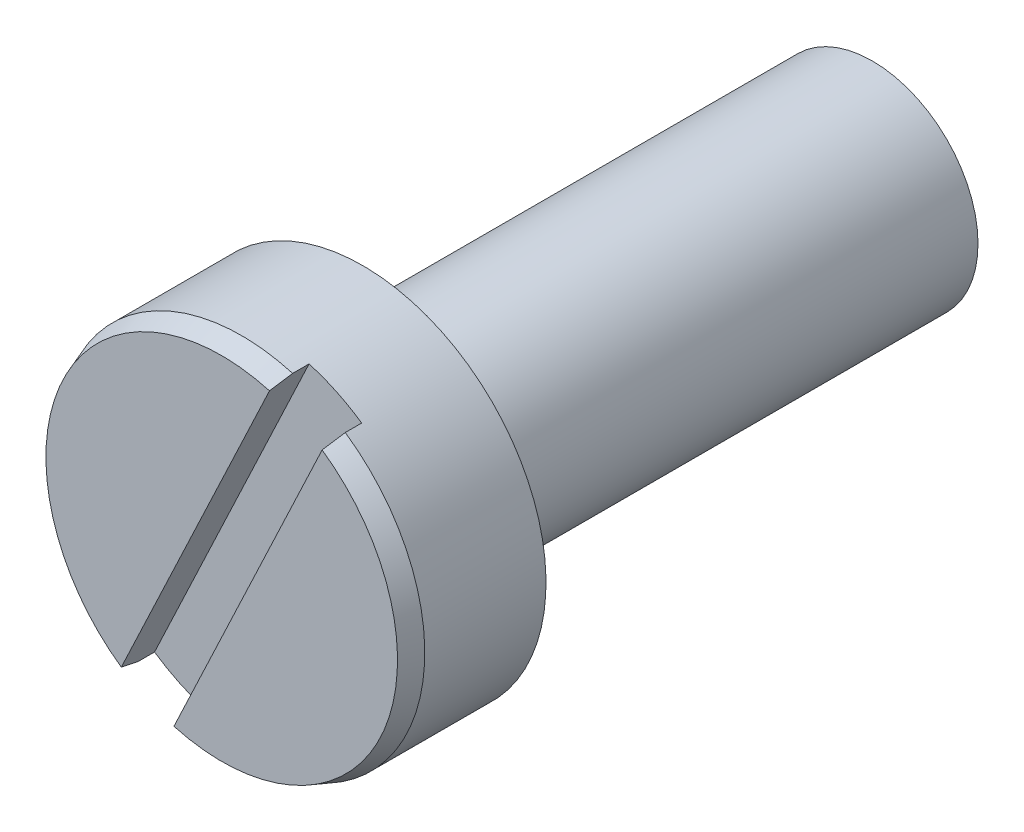
ISO-10303-21;
HEADER;
FILE_DESCRIPTION(('STEP AP214'),'2;1');
FILE_NAME('part.step','',(''),(''),'','','');
FILE_SCHEMA(('AUTOMOTIVE_DESIGN { 1 0 10303 214 1 1 1 1 }'));
ENDSEC;
DATA;
#1=APPLICATION_CONTEXT('core data for automotive mechanical design processes');
#2=APPLICATION_PROTOCOL_DEFINITION('international standard','automotive_design',2000,#1);
#3=PRODUCT_CONTEXT('',#1,'mechanical');
#4=PRODUCT('Part','Part','',(#3));
#5=PRODUCT_RELATED_PRODUCT_CATEGORY('part','',(#4));
#6=PRODUCT_DEFINITION_FORMATION('','',#4);
#7=PRODUCT_DEFINITION_CONTEXT('part definition',#1,'design');
#8=PRODUCT_DEFINITION('design','',#6,#7);
#9=PRODUCT_DEFINITION_SHAPE('','',#8);
#10=(LENGTH_UNIT() NAMED_UNIT(*) SI_UNIT(.MILLI.,.METRE.));
#11=(NAMED_UNIT(*) PLANE_ANGLE_UNIT() SI_UNIT($,.RADIAN.));
#12=(NAMED_UNIT(*) SI_UNIT($,.STERADIAN.) SOLID_ANGLE_UNIT());
#13=UNCERTAINTY_MEASURE_WITH_UNIT(LENGTH_MEASURE(1.E-05),#10,'distance_accuracy_value','');
#14=(GEOMETRIC_REPRESENTATION_CONTEXT(3) GLOBAL_UNCERTAINTY_ASSIGNED_CONTEXT((#13)) GLOBAL_UNIT_ASSIGNED_CONTEXT((#10,
#11,#12)) REPRESENTATION_CONTEXT('',''));
#15=CARTESIAN_POINT('',(0.,0.,0.));
#16=DIRECTION('',(0.,0.,1.));
#17=DIRECTION('',(1.,0.,0.));
#18=AXIS2_PLACEMENT_3D('',#15,#16,#17);
#19=CARTESIAN_POINT('',(-22.8478019032069,-23.3190294111925,19.8));
#20=DIRECTION('',(0.,0.,-1.));
#21=DIRECTION('',(0.427457329703379,0.904035525453982,0.));
#22=AXIS2_PLACEMENT_3D('',#19,#20,#21);
#23=TOROIDAL_SURFACE('',#22,1.95,0.5);
#24=CARTESIAN_POINT('',(-22.8478019032069,-23.3190294111925,19.8));
#25=DIRECTION('',(0.,0.,-1.));
#26=DIRECTION('',(0.427457329703379,0.904035525453982,0.));
#27=AXIS2_PLACEMENT_3D('',#24,#25,#26);
#28=CIRCLE('',#27,1.45);
#29=CARTESIAN_POINT('',(-22.227988775137,-22.0081778992842,19.8));
#30=VERTEX_POINT('',#29);
#31=EDGE_CURVE('E11',#30,#30,#28,.T.);
#32=ORIENTED_EDGE('',*,*,#31,.F.);
#33=EDGE_LOOP('',(#32));
#34=FACE_BOUND('',#33,.T.);
#35=CARTESIAN_POINT('',(-22.8478019032069,-23.3190294111928,20.3));
#36=DIRECTION('',(0.,0.,1.));
#37=DIRECTION('',(0.427457329703379,0.904035525453982,0.));
#38=AXIS2_PLACEMENT_3D('',#35,#36,#37);
#39=CIRCLE('',#38,1.95);
#40=CARTESIAN_POINT('',(-22.0142601102853,-21.5561601365575,20.3));
#41=VERTEX_POINT('',#40);
#42=EDGE_CURVE('E125',#41,#41,#39,.T.);
#43=ORIENTED_EDGE('',*,*,#42,.F.);
#44=EDGE_LOOP('',(#43));
#45=FACE_BOUND('',#44,.T.);
#46=ADVANCED_FACE('F17',(#34,#45),#23,.F.);
#47=CARTESIAN_POINT('',(-22.8478019032069,-23.3190294111927,13.3));
#48=DIRECTION('',(0.,0.,1.));
#49=DIRECTION('',(-0.427457329703379,-0.904035525453982,0.));
#50=AXIS2_PLACEMENT_3D('',#47,#48,#49);
#51=CONICAL_SURFACE('',#50,1.175252258055,1.221730476396);
#52=CARTESIAN_POINT('',(-22.8478019032069,-23.3190294111927,13.3));
#53=DIRECTION('',(0.,0.,-1.));
#54=DIRECTION('',(0.427457329703379,0.904035525453982,0.));
#55=AXIS2_PLACEMENT_3D('',#52,#53,#54);
#56=CIRCLE('',#55,1.175252258055);
#57=CARTESIAN_POINT('',(-22.3454317112508,-22.2565596185409,13.3));
#58=VERTEX_POINT('',#57);
#59=EDGE_CURVE('E110',#58,#58,#56,.T.);
#60=ORIENTED_EDGE('',*,*,#59,.F.);
#61=EDGE_LOOP('',(#60));
#62=FACE_BOUND('',#61,.T.);
#63=CARTESIAN_POINT('',(-22.8478019032069,-23.3190294111925,13.4));
#64=DIRECTION('',(0.,0.,1.));
#65=DIRECTION('',(0.427457329703379,0.904035525453982,0.));
#66=AXIS2_PLACEMENT_3D('',#63,#64,#65);
#67=CIRCLE('',#66,1.45);
#68=CARTESIAN_POINT('',(-22.227988775137,-22.0081778992842,13.4));
#69=VERTEX_POINT('',#68);
#70=EDGE_CURVE('E26',#69,#69,#67,.T.);
#71=ORIENTED_EDGE('',*,*,#70,.F.);
#72=EDGE_LOOP('',(#71));
#73=FACE_BOUND('',#72,.T.);
#74=ADVANCED_FACE('F181',(#62,#73),#51,.T.);
#75=CARTESIAN_POINT('',(-22.8478019032069,-23.3190294111928,20.3));
#76=DIRECTION('',(0.,0.,1.));
#77=DIRECTION('',(-0.427457329703379,-0.904035525453982,0.));
#78=AXIS2_PLACEMENT_3D('',#75,#76,#77);
#79=CONICAL_SURFACE('',#78,2.240252258055,1.221730476396);
#80=CARTESIAN_POINT('',(-22.8478019032069,-23.3190294111928,20.3));
#81=DIRECTION('',(0.,0.,-1.));
#82=DIRECTION('',(0.427457329703379,0.904035525453982,0.));
#83=AXIS2_PLACEMENT_3D('',#80,#81,#82);
#84=CIRCLE('',#83,2.240252258055);
#85=CARTESIAN_POINT('',(-21.8901896551167,-21.2937617839326,20.3));
#86=VERTEX_POINT('',#85);
#87=EDGE_CURVE('E121',#86,#86,#84,.T.);
#88=ORIENTED_EDGE('',*,*,#87,.F.);
#89=EDGE_LOOP('',(#88));
#90=FACE_BOUND('',#89,.T.);
#91=CARTESIAN_POINT('',(-22.8478019032069,-23.3190294111927,20.4));
#92=DIRECTION('',(0.,0.,1.));
#93=DIRECTION('',(0.427457329703379,0.904035525453982,0.));
#94=AXIS2_PLACEMENT_3D('',#91,#92,#93);
#95=CIRCLE('',#94,2.515);
#96=CARTESIAN_POINT('',(-21.7727467190029,-21.0453800646759,20.4));
#97=VERTEX_POINT('',#96);
#98=EDGE_CURVE('E68',#97,#97,#95,.T.);
#99=ORIENTED_EDGE('',*,*,#98,.F.);
#100=EDGE_LOOP('',(#99));
#101=FACE_BOUND('',#100,.T.);
#102=ADVANCED_FACE('F186',(#90,#101),#79,.T.);
#103=CARTESIAN_POINT('',(-22.8478019032069,-23.3190294111927,13.3));
#104=DIRECTION('',(0.,0.,-1.));
#105=DIRECTION('',(0.427457329703379,0.904035525453982,0.));
#106=AXIS2_PLACEMENT_3D('',#103,#104,#105);
#107=CYLINDRICAL_SURFACE('',#106,1.45);
#108=ORIENTED_EDGE('',*,*,#31,.T.);
#109=EDGE_LOOP('',(#108));
#110=FACE_BOUND('',#109,.T.);
#111=ORIENTED_EDGE('',*,*,#70,.T.);
#112=EDGE_LOOP('',(#111));
#113=FACE_BOUND('',#112,.T.);
#114=ADVANCED_FACE('F174',(#110,#113),#107,.T.);
#115=CARTESIAN_POINT('',(-22.8478019032069,-23.3190294111927,13.3));
#116=DIRECTION('',(0.,0.,-1.));
#117=DIRECTION('',(0.427457329703379,0.904035525453982,0.));
#118=AXIS2_PLACEMENT_3D('',#115,#116,#117);
#119=CYLINDRICAL_SURFACE('',#118,2.515);
#120=CARTESIAN_POINT('',(-22.8478019032069,-23.3190294111933,21.84));
#121=DIRECTION('',(0.,0.,-1.));
#122=DIRECTION('',(-0.427457329703369,-0.904035525453986,0.));
#123=AXIS2_PLACEMENT_3D('',#120,#121,#122);
#124=CIRCLE('',#123,2.515);
#125=CARTESIAN_POINT('',(-23.5475587337498,-25.7347209018659,21.84));
#126=VERTEX_POINT('',#125);
#127=CARTESIAN_POINT('',(-24.2707871541138,-25.3927550381032,21.84));
#128=VERTEX_POINT('',#127);
#129=EDGE_CURVE('E145',#126,#128,#124,.T.);
#130=ORIENTED_EDGE('',*,*,#129,.T.);
#131=DIRECTION('',(0.,0.,-1.));
#132=VECTOR('',#131,1.);
#133=CARTESIAN_POINT('',(-24.2707871541128,-25.3927550381031,13.3));
#134=LINE('',#133,#132);
#135=CARTESIAN_POINT('',(-24.2707871541138,-25.3927550381032,22.0652522580551));
#136=VERTEX_POINT('',#135);
#137=EDGE_CURVE('E64',#136,#128,#134,.T.);
#138=ORIENTED_EDGE('',*,*,#137,.F.);
#139=CARTESIAN_POINT('',(-22.8478019032069,-23.3190294111931,22.065252258055));
#140=DIRECTION('',(0.,0.,-1.));
#141=DIRECTION('',(-0.427457329703379,-0.904035525453982,0.));
#142=AXIS2_PLACEMENT_3D('',#139,#140,#141);
#143=CIRCLE('',#142,2.515);
#144=CARTESIAN_POINT('',(-22.1480450726639,-20.9033379205202,22.0652522580551));
#145=VERTEX_POINT('',#144);
#146=EDGE_CURVE('E53',#136,#145,#143,.T.);
#147=ORIENTED_EDGE('',*,*,#146,.T.);
#148=DIRECTION('',(0.,0.,1.));
#149=VECTOR('',#148,1.);
#150=CARTESIAN_POINT('',(-22.1480450726639,-20.9033379205197,13.3));
#151=LINE('',#150,#149);
#152=CARTESIAN_POINT('',(-22.1480450726639,-20.9033379205203,21.84));
#153=VERTEX_POINT('',#152);
#154=EDGE_CURVE('E61',#153,#145,#151,.T.);
#155=ORIENTED_EDGE('',*,*,#154,.F.);
#156=CARTESIAN_POINT('',(-22.8478019032069,-23.3190294111933,21.84));
#157=DIRECTION('',(0.,0.,-1.));
#158=DIRECTION('',(-0.427457329703379,-0.904035525453982,0.));
#159=AXIS2_PLACEMENT_3D('',#156,#157,#158);
#160=CIRCLE('',#159,2.515);
#161=CARTESIAN_POINT('',(-21.4248166523009,-21.2453037842822,21.84));
#162=VERTEX_POINT('',#161);
#163=EDGE_CURVE('E93',#153,#162,#160,.T.);
#164=ORIENTED_EDGE('',*,*,#163,.T.);
#165=DIRECTION('',(0.,0.,-1.));
#166=VECTOR('',#165,1.);
#167=CARTESIAN_POINT('',(-21.4248166522999,-21.2453037842826,13.3));
#168=LINE('',#167,#166);
#169=CARTESIAN_POINT('',(-21.4248166523009,-21.2453037842831,22.0652522580551));
#170=VERTEX_POINT('',#169);
#171=EDGE_CURVE('E96',#170,#162,#168,.T.);
#172=ORIENTED_EDGE('',*,*,#171,.F.);
#173=CARTESIAN_POINT('',(-23.5475587337498,-25.7347209018659,22.0652522580551));
#174=VERTEX_POINT('',#173);
#175=EDGE_CURVE('E106',#170,#174,#143,.T.);
#176=ORIENTED_EDGE('',*,*,#175,.T.);
#177=DIRECTION('',(0.,0.,1.));
#178=VECTOR('',#177,1.);
#179=CARTESIAN_POINT('',(-23.5475587337498,-25.7347209018658,13.3));
#180=LINE('',#179,#178);
#181=EDGE_CURVE('E103',#126,#174,#180,.T.);
#182=ORIENTED_EDGE('',*,*,#181,.F.);
#183=EDGE_LOOP('',(#130,#138,#147,#155,#164,#172,#176,#182));
#184=FACE_BOUND('',#183,.T.);
#185=ORIENTED_EDGE('',*,*,#98,.T.);
#186=EDGE_LOOP('',(#185));
#187=FACE_BOUND('',#186,.T.);
#188=ADVANCED_FACE('F56',(#184,#187),#119,.T.);
#189=CARTESIAN_POINT('',(-22.8478019032069,-23.3190294111925,22.34));
#190=DIRECTION('',(0.,0.,1.));
#191=DIRECTION('',(-0.427457329703379,-0.904035525453982,0.));
#192=AXIS2_PLACEMENT_3D('',#189,#190,#191);
#193=PLANE('',#192);
#194=DIRECTION('',(-0.427457329703379,-0.904035525453982,0.));
#195=VECTOR('',#194,1.);
#196=CARTESIAN_POINT('',(-24.5072657778918,-25.8928870092974,22.34));
#197=LINE('',#196,#195);
#198=CARTESIAN_POINT('',(-22.1913652108738,-20.9949562907945,22.34));
#199=VERTEX_POINT('',#198);
#200=CARTESIAN_POINT('',(-24.2274670159038,-25.3011366678286,22.34));
#201=VERTEX_POINT('',#200);
#202=EDGE_CURVE('E76',#199,#201,#197,.T.);
#203=ORIENTED_EDGE('',*,*,#202,.F.);
#204=CARTESIAN_POINT('',(-22.8478019032069,-23.3190294111925,22.34));
#205=DIRECTION('',(0.,0.,1.));
#206=DIRECTION('',(-0.427457329703379,-0.904035525453982,0.));
#207=AXIS2_PLACEMENT_3D('',#204,#205,#206);
#208=CIRCLE('',#207,2.415);
#209=EDGE_CURVE('E36',#199,#201,#208,.T.);
#210=ORIENTED_EDGE('',*,*,#209,.T.);
#211=EDGE_LOOP('',(#203,#210));
#212=FACE_BOUND('',#211,.T.);
#213=ADVANCED_FACE('F163',(#212),#193,.T.);
#214=CARTESIAN_POINT('',(-22.8478019032069,-23.3190294111931,22.065252258055));
#215=DIRECTION('',(0.,0.,-1.));
#216=DIRECTION('',(0.427457329703379,0.904035525453982,0.));
#217=AXIS2_PLACEMENT_3D('',#214,#215,#216);
#218=CONICAL_SURFACE('',#217,2.515,0.349065850399);
#219=CARTESIAN_POINT('',(304.397732713188,669.712925477798,-261.393080578831));
#220=DIRECTION('',(0.904035525452299,-0.427457329706938,1.46077674032882E-12));
#221=DIRECTION('',(-0.401017918661995,-0.848118442749434,0.346236531839547));
#222=AXIS2_PLACEMENT_3D('',#219,#220,#221);
#223=CIRCLE('',#222,819.477595478914);
#224=EDGE_CURVE('E153',#201,#136,#223,.T.);
#225=ORIENTED_EDGE('',*,*,#224,.F.);
#226=ORIENTED_EDGE('',*,*,#209,.F.);
#227=CARTESIAN_POINT('',(-350.816562303541,-716.009012868667,-261.3930783065));
#228=DIRECTION('',(0.904035525453982,-0.427457329703379,0.));
#229=DIRECTION('',(0.401070781773213,0.848230243697522,0.345901260021795));
#230=AXIS2_PLACEMENT_3D('',#227,#228,#229);
#231=CIRCLE('',#230,819.477588912782);
#232=EDGE_CURVE('E71',#145,#199,#231,.T.);
#233=ORIENTED_EDGE('',*,*,#232,.F.);
#234=ORIENTED_EDGE('',*,*,#146,.F.);
#235=EDGE_LOOP('',(#225,#226,#233,#234));
#236=FACE_BOUND('',#235,.T.);
#237=ADVANCED_FACE('F72',(#236),#218,.T.);
#238=DIRECTION('',(0.427457329703379,0.904035525453982,0.));
#239=VECTOR('',#238,1.);
#240=CARTESIAN_POINT('',(-23.7840373575288,-26.23485287306,22.34));
#241=LINE('',#240,#239);
#242=CARTESIAN_POINT('',(-23.5042385955398,-25.6431025315914,22.34));
#243=VERTEX_POINT('',#242);
#244=CARTESIAN_POINT('',(-21.4681367905098,-21.3369221545575,22.34));
#245=VERTEX_POINT('',#244);
#246=EDGE_CURVE('E246',#243,#245,#241,.T.);
#247=ORIENTED_EDGE('',*,*,#246,.F.);
#248=EDGE_CURVE('E111',#243,#245,#208,.T.);
#249=ORIENTED_EDGE('',*,*,#248,.T.);
#250=EDGE_LOOP('',(#247,#249));
#251=FACE_BOUND('',#250,.T.);
#252=ADVANCED_FACE('F166',(#251),#193,.T.);
#253=CARTESIAN_POINT('',(-20.5741525566898,-24.3940845953968,20.3));
#254=DIRECTION('',(0.,0.,-1.));
#255=DIRECTION('',(0.427457329703379,0.904035525453982,0.));
#256=AXIS2_PLACEMENT_3D('',#253,#254,#255);
#257=PLANE('',#256);
#258=ORIENTED_EDGE('',*,*,#42,.T.);
#259=EDGE_LOOP('',(#258));
#260=FACE_BOUND('',#259,.T.);
#261=ORIENTED_EDGE('',*,*,#87,.T.);
#262=EDGE_LOOP('',(#261));
#263=FACE_BOUND('',#262,.T.);
#264=ADVANCED_FACE('F178',(#260,#263),#257,.T.);
#265=CARTESIAN_POINT('',(-21.5369503912988,-23.9388425392626,13.3));
#266=DIRECTION('',(0.,0.,-1.));
#267=DIRECTION('',(0.427457329703379,0.904035525453982,0.));
#268=AXIS2_PLACEMENT_3D('',#265,#266,#267);
#269=PLANE('',#268);
#270=ORIENTED_EDGE('',*,*,#59,.T.);
#271=EDGE_LOOP('',(#270));
#272=FACE_BOUND('',#271,.T.);
#273=ADVANCED_FACE('F208',(#272),#269,.T.);
#274=CARTESIAN_POINT('',(-350.093336519593,-716.350984300179,-261.393080578849));
#275=DIRECTION('',(-0.904035525452299,0.427457329706938,1.44341947337369E-12));
#276=DIRECTION('',(0.401017918661986,0.848118442749428,0.346236531839572));
#277=AXIS2_PLACEMENT_3D('',#274,#275,#276);
#278=CIRCLE('',#277,819.477595478914);
#279=EDGE_CURVE('E86',#245,#170,#278,.T.);
#280=ORIENTED_EDGE('',*,*,#279,.F.);
#281=ORIENTED_EDGE('',*,*,#248,.F.);
#282=CARTESIAN_POINT('',(305.120958497134,669.370954046286,-261.39307830648));
#283=DIRECTION('',(-0.904035525453982,0.427457329703379,0.));
#284=DIRECTION('',(-0.401070781773222,-0.848230243697527,0.345901260021773));
#285=AXIS2_PLACEMENT_3D('',#282,#283,#284);
#286=CIRCLE('',#285,819.477588912782);
#287=EDGE_CURVE('E115',#174,#243,#286,.T.);
#288=ORIENTED_EDGE('',*,*,#287,.F.);
#289=ORIENTED_EDGE('',*,*,#175,.F.);
#290=EDGE_LOOP('',(#280,#281,#288,#289));
#291=FACE_BOUND('',#290,.T.);
#292=ADVANCED_FACE('F173',(#291),#218,.T.);
#293=CARTESIAN_POINT('',(-24.5072657778918,-25.8928870092974,21.84));
#294=DIRECTION('',(-0.904035525453982,0.427457329703379,0.));
#295=DIRECTION('',(-0.427457329703379,-0.904035525453982,0.));
#296=AXIS2_PLACEMENT_3D('',#293,#294,#295);
#297=PLANE('',#296);
#298=ORIENTED_EDGE('',*,*,#137,.T.);
#299=DIRECTION('',(-0.427457329703379,-0.904035525453982,0.));
#300=VECTOR('',#299,1.);
#301=CARTESIAN_POINT('',(-24.5072657778918,-25.8928870092974,21.84));
#302=LINE('',#301,#300);
#303=EDGE_CURVE('E81',#153,#128,#302,.T.);
#304=ORIENTED_EDGE('',*,*,#303,.F.);
#305=ORIENTED_EDGE('',*,*,#154,.T.);
#306=ORIENTED_EDGE('',*,*,#232,.T.);
#307=ORIENTED_EDGE('',*,*,#202,.T.);
#308=ORIENTED_EDGE('',*,*,#224,.T.);
#309=EDGE_LOOP('',(#298,#304,#305,#306,#307,#308));
#310=FACE_BOUND('',#309,.T.);
#311=ADVANCED_FACE('F79',(#310),#297,.F.);
#312=CARTESIAN_POINT('',(-23.7840373575288,-26.23485287306,21.84));
#313=DIRECTION('',(0.904035525453982,-0.427457329703379,0.));
#314=DIRECTION('',(0.427457329703379,0.904035525453982,0.));
#315=AXIS2_PLACEMENT_3D('',#312,#313,#314);
#316=PLANE('',#315);
#317=ORIENTED_EDGE('',*,*,#171,.T.);
#318=DIRECTION('',(0.427457329703379,0.904035525453982,0.));
#319=VECTOR('',#318,1.);
#320=CARTESIAN_POINT('',(-23.7840373575288,-26.23485287306,21.84));
#321=LINE('',#320,#319);
#322=EDGE_CURVE('E97',#126,#162,#321,.T.);
#323=ORIENTED_EDGE('',*,*,#322,.F.);
#324=ORIENTED_EDGE('',*,*,#181,.T.);
#325=ORIENTED_EDGE('',*,*,#287,.T.);
#326=ORIENTED_EDGE('',*,*,#246,.T.);
#327=ORIENTED_EDGE('',*,*,#279,.T.);
#328=EDGE_LOOP('',(#317,#323,#324,#325,#326,#327));
#329=FACE_BOUND('',#328,.T.);
#330=ADVANCED_FACE('F217',(#329),#316,.F.);
#331=CARTESIAN_POINT('',(-22.8478019032069,-23.3190294111933,21.84));
#332=DIRECTION('',(0.,0.,1.));
#333=DIRECTION('',(-0.427457329703379,-0.904035525453982,0.));
#334=AXIS2_PLACEMENT_3D('',#331,#332,#333);
#335=PLANE('',#334);
#336=ORIENTED_EDGE('',*,*,#303,.T.);
#337=ORIENTED_EDGE('',*,*,#129,.F.);
#338=ORIENTED_EDGE('',*,*,#322,.T.);
#339=ORIENTED_EDGE('',*,*,#163,.F.);
#340=EDGE_LOOP('',(#336,#337,#338,#339));
#341=FACE_BOUND('',#340,.T.);
#342=ADVANCED_FACE('F220',(#341),#335,.T.);
#343=CLOSED_SHELL('',(#46,#74,#102,#114,#188,#213,#237,#252,#264,#273,#292,#311,#330,#342));
#344=MANIFOLD_SOLID_BREP('B1',#343);
#345=ADVANCED_BREP_SHAPE_REPRESENTATION('',(#18,#344),#14);
#346=SHAPE_DEFINITION_REPRESENTATION(#9,#345);
ENDSEC;
END-ISO-10303-21;
